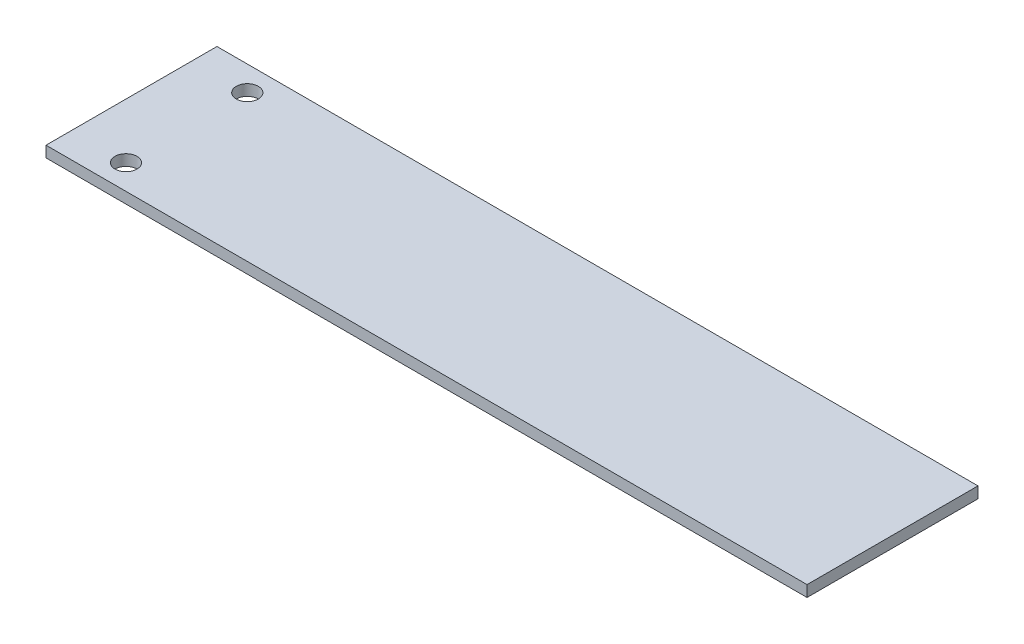
ISO-10303-21;
HEADER;
FILE_DESCRIPTION(('STEP AP214'),'2;1');
FILE_NAME('part.step','',(''),(''),'','','');
FILE_SCHEMA(('AUTOMOTIVE_DESIGN { 1 0 10303 214 1 1 1 1 }'));
ENDSEC;
DATA;
#1=APPLICATION_CONTEXT('core data for automotive mechanical design processes');
#2=APPLICATION_PROTOCOL_DEFINITION('international standard','automotive_design',2000,#1);
#3=PRODUCT_CONTEXT('',#1,'mechanical');
#4=PRODUCT('Part','Part','',(#3));
#5=PRODUCT_RELATED_PRODUCT_CATEGORY('part','',(#4));
#6=PRODUCT_DEFINITION_FORMATION('','',#4);
#7=PRODUCT_DEFINITION_CONTEXT('part definition',#1,'design');
#8=PRODUCT_DEFINITION('design','',#6,#7);
#9=PRODUCT_DEFINITION_SHAPE('','',#8);
#10=(LENGTH_UNIT() NAMED_UNIT(*) SI_UNIT(.MILLI.,.METRE.));
#11=(NAMED_UNIT(*) PLANE_ANGLE_UNIT() SI_UNIT($,.RADIAN.));
#12=(NAMED_UNIT(*) SI_UNIT($,.STERADIAN.) SOLID_ANGLE_UNIT());
#13=UNCERTAINTY_MEASURE_WITH_UNIT(LENGTH_MEASURE(1.E-05),#10,'distance_accuracy_value','');
#14=(GEOMETRIC_REPRESENTATION_CONTEXT(3) GLOBAL_UNCERTAINTY_ASSIGNED_CONTEXT((#13)) GLOBAL_UNIT_ASSIGNED_CONTEXT((#10,
#11,#12)) REPRESENTATION_CONTEXT('',''));
#15=CARTESIAN_POINT('',(0.,0.,0.));
#16=DIRECTION('',(0.,0.,1.));
#17=DIRECTION('',(1.,0.,0.));
#18=AXIS2_PLACEMENT_3D('',#15,#16,#17);
#19=CARTESIAN_POINT('',(0.,1.,0.));
#20=DIRECTION('',(0.,-1.,0.));
#21=DIRECTION('',(0.,0.,-1.));
#22=AXIS2_PLACEMENT_3D('',#19,#20,#21);
#23=PLANE('',#22);
#24=CARTESIAN_POINT('',(-6.80132450331126,1.,-5.25993377483443));
#25=DIRECTION('',(0.,1.,0.));
#26=DIRECTION('',(0.,0.,1.));
#27=AXIS2_PLACEMENT_3D('',#24,#25,#26);
#28=CIRCLE('',#27,0.999999999999997);
#29=CARTESIAN_POINT('',(-6.80132450331126,1.,-4.25993377483444));
#30=VERTEX_POINT('',#29);
#31=EDGE_CURVE('E156',#30,#30,#28,.T.);
#32=ORIENTED_EDGE('',*,*,#31,.F.);
#33=EDGE_LOOP('',(#32));
#34=FACE_BOUND('',#33,.T.);
#35=DIRECTION('',(0.,0.,1.));
#36=VECTOR('',#35,1.);
#37=CARTESIAN_POINT('',(-11.8013245033113,1.,7.99006622516557));
#38=LINE('',#37,#36);
#39=CARTESIAN_POINT('',(-11.8013245033113,1.,-7.50993377483443));
#40=VERTEX_POINT('',#39);
#41=CARTESIAN_POINT('',(-11.8013245033113,1.,7.99006622516557));
#42=VERTEX_POINT('',#41);
#43=EDGE_CURVE('E89',#40,#42,#38,.T.);
#44=ORIENTED_EDGE('',*,*,#43,.T.);
#45=DIRECTION('',(1.,0.,0.));
#46=VECTOR('',#45,1.);
#47=CARTESIAN_POINT('',(-11.8013245033113,1.,7.99006622516557));
#48=LINE('',#47,#46);
#49=CARTESIAN_POINT('',(57.1986754966888,1.,7.99006622516556));
#50=VERTEX_POINT('',#49);
#51=EDGE_CURVE('E173',#42,#50,#48,.T.);
#52=ORIENTED_EDGE('',*,*,#51,.T.);
#53=DIRECTION('',(0.,0.,1.));
#54=VECTOR('',#53,1.);
#55=CARTESIAN_POINT('',(57.1986754966888,1.,7.99006622516556));
#56=LINE('',#55,#54);
#57=CARTESIAN_POINT('',(57.1986754966887,1.,-7.50993377483445));
#58=VERTEX_POINT('',#57);
#59=EDGE_CURVE('E151',#58,#50,#56,.T.);
#60=ORIENTED_EDGE('',*,*,#59,.F.);
#61=DIRECTION('',(-1.,0.,0.));
#62=VECTOR('',#61,1.);
#63=CARTESIAN_POINT('',(-11.8013245033113,1.,-7.50993377483443));
#64=LINE('',#63,#62);
#65=EDGE_CURVE('E59',#58,#40,#64,.T.);
#66=ORIENTED_EDGE('',*,*,#65,.T.);
#67=EDGE_LOOP('',(#44,#52,#60,#66));
#68=FACE_BOUND('',#67,.T.);
#69=CARTESIAN_POINT('',(-6.80132450331126,1.,5.74006622516556));
#70=DIRECTION('',(0.,1.,0.));
#71=DIRECTION('',(0.,0.,1.));
#72=AXIS2_PLACEMENT_3D('',#69,#70,#71);
#73=CIRCLE('',#72,0.999999999999997);
#74=CARTESIAN_POINT('',(-6.80132450331126,1.,6.74006622516556));
#75=VERTEX_POINT('',#74);
#76=EDGE_CURVE('E105',#75,#75,#73,.T.);
#77=ORIENTED_EDGE('',*,*,#76,.F.);
#78=EDGE_LOOP('',(#77));
#79=FACE_BOUND('',#78,.T.);
#80=ADVANCED_FACE('F41',(#34,#68,#79),#23,.F.);
#81=CARTESIAN_POINT('',(-11.8013245033113,1.,7.99006622516557));
#82=DIRECTION('',(1.,0.,0.));
#83=DIRECTION('',(0.,0.,-1.));
#84=AXIS2_PLACEMENT_3D('',#81,#82,#83);
#85=PLANE('',#84);
#86=DIRECTION('',(0.,0.,1.));
#87=VECTOR('',#86,1.);
#88=CARTESIAN_POINT('',(-11.8013245033113,0.,7.99006622516557));
#89=LINE('',#88,#87);
#90=CARTESIAN_POINT('',(-11.8013245033113,0.,-7.50993377483443));
#91=VERTEX_POINT('',#90);
#92=CARTESIAN_POINT('',(-11.8013245033113,0.,7.99006622516557));
#93=VERTEX_POINT('',#92);
#94=EDGE_CURVE('E95',#91,#93,#89,.T.);
#95=ORIENTED_EDGE('',*,*,#94,.T.);
#96=DIRECTION('',(0.,-1.,0.));
#97=VECTOR('',#96,1.);
#98=CARTESIAN_POINT('',(-11.8013245033113,1.,7.99006622516557));
#99=LINE('',#98,#97);
#100=EDGE_CURVE('E11',#42,#93,#99,.T.);
#101=ORIENTED_EDGE('',*,*,#100,.F.);
#102=ORIENTED_EDGE('',*,*,#43,.F.);
#103=DIRECTION('',(0.,-1.,0.));
#104=VECTOR('',#103,1.);
#105=CARTESIAN_POINT('',(-11.8013245033113,1.,-7.50993377483443));
#106=LINE('',#105,#104);
#107=EDGE_CURVE('E51',#40,#91,#106,.T.);
#108=ORIENTED_EDGE('',*,*,#107,.T.);
#109=EDGE_LOOP('',(#95,#101,#102,#108));
#110=FACE_BOUND('',#109,.T.);
#111=ADVANCED_FACE('F43',(#110),#85,.F.);
#112=CARTESIAN_POINT('',(-11.8013245033113,1.,7.99006622516557));
#113=DIRECTION('',(0.,0.,-1.));
#114=DIRECTION('',(-1.,0.,0.));
#115=AXIS2_PLACEMENT_3D('',#112,#113,#114);
#116=PLANE('',#115);
#117=DIRECTION('',(1.,0.,0.));
#118=VECTOR('',#117,1.);
#119=CARTESIAN_POINT('',(-11.8013245033113,0.,7.99006622516557));
#120=LINE('',#119,#118);
#121=CARTESIAN_POINT('',(7.19867549668874,0.,7.99006622516557));
#122=VERTEX_POINT('',#121);
#123=EDGE_CURVE('E72',#93,#122,#120,.T.);
#124=ORIENTED_EDGE('',*,*,#123,.T.);
#125=DIRECTION('',(0.,-1.,0.));
#126=VECTOR('',#125,1.);
#127=CARTESIAN_POINT('',(7.19867549668874,1.,7.99006622516557));
#128=LINE('',#127,#126);
#129=CARTESIAN_POINT('',(7.19867549668874,-0.0159048308691668,7.99006622516557));
#130=VERTEX_POINT('',#129);
#131=EDGE_CURVE('E116',#122,#130,#128,.T.);
#132=ORIENTED_EDGE('',*,*,#131,.T.);
#133=DIRECTION('',(-1.,0.,0.));
#134=VECTOR('',#133,1.);
#135=CARTESIAN_POINT('',(57.1986754966888,-0.0159048308691668,7.99006622516556));
#136=LINE('',#135,#134);
#137=CARTESIAN_POINT('',(57.1986754966888,-0.0159048308691668,7.99006622516556));
#138=VERTEX_POINT('',#137);
#139=EDGE_CURVE('E139',#138,#130,#136,.T.);
#140=ORIENTED_EDGE('',*,*,#139,.F.);
#141=DIRECTION('',(0.,-1.,0.));
#142=VECTOR('',#141,1.);
#143=CARTESIAN_POINT('',(57.1986754966888,1.,7.99006622516556));
#144=LINE('',#143,#142);
#145=EDGE_CURVE('E146',#50,#138,#144,.T.);
#146=ORIENTED_EDGE('',*,*,#145,.F.);
#147=ORIENTED_EDGE('',*,*,#51,.F.);
#148=ORIENTED_EDGE('',*,*,#100,.T.);
#149=EDGE_LOOP('',(#124,#132,#140,#146,#147,#148));
#150=FACE_BOUND('',#149,.T.);
#151=ADVANCED_FACE('F154',(#150),#116,.F.);
#152=CARTESIAN_POINT('',(-11.8013245033113,1.,-7.50993377483443));
#153=DIRECTION('',(0.,0.,1.));
#154=DIRECTION('',(1.,0.,0.));
#155=AXIS2_PLACEMENT_3D('',#152,#153,#154);
#156=PLANE('',#155);
#157=DIRECTION('',(-1.,0.,0.));
#158=VECTOR('',#157,1.);
#159=CARTESIAN_POINT('',(-11.8013245033113,0.,-7.50993377483443));
#160=LINE('',#159,#158);
#161=CARTESIAN_POINT('',(7.19867549668874,0.,-7.50993377483443));
#162=VERTEX_POINT('',#161);
#163=EDGE_CURVE('E78',#162,#91,#160,.T.);
#164=ORIENTED_EDGE('',*,*,#163,.T.);
#165=ORIENTED_EDGE('',*,*,#107,.F.);
#166=ORIENTED_EDGE('',*,*,#65,.F.);
#167=DIRECTION('',(0.,1.,0.));
#168=VECTOR('',#167,1.);
#169=CARTESIAN_POINT('',(57.1986754966887,1.,-7.50993377483445));
#170=LINE('',#169,#168);
#171=CARTESIAN_POINT('',(57.1986754966887,-0.0159048308691668,-7.50993377483445));
#172=VERTEX_POINT('',#171);
#173=EDGE_CURVE('E145',#172,#58,#170,.T.);
#174=ORIENTED_EDGE('',*,*,#173,.F.);
#175=DIRECTION('',(-1.,0.,0.));
#176=VECTOR('',#175,1.);
#177=CARTESIAN_POINT('',(57.1986754966887,-0.0159048308691668,-7.50993377483445));
#178=LINE('',#177,#176);
#179=CARTESIAN_POINT('',(7.19867549668874,-0.0159048308691668,-7.50993377483443));
#180=VERTEX_POINT('',#179);
#181=EDGE_CURVE('E140',#172,#180,#178,.T.);
#182=ORIENTED_EDGE('',*,*,#181,.T.);
#183=DIRECTION('',(0.,1.,0.));
#184=VECTOR('',#183,1.);
#185=CARTESIAN_POINT('',(7.19867549668874,1.,-7.50993377483443));
#186=LINE('',#185,#184);
#187=EDGE_CURVE('E84',#180,#162,#186,.T.);
#188=ORIENTED_EDGE('',*,*,#187,.T.);
#189=EDGE_LOOP('',(#164,#165,#166,#174,#182,#188));
#190=FACE_BOUND('',#189,.T.);
#191=ADVANCED_FACE('F80',(#190),#156,.F.);
#192=CARTESIAN_POINT('',(0.,0.,0.));
#193=DIRECTION('',(0.,-1.,0.));
#194=DIRECTION('',(0.,0.,-1.));
#195=AXIS2_PLACEMENT_3D('',#192,#193,#194);
#196=PLANE('',#195);
#197=CARTESIAN_POINT('',(-6.80132450331126,0.,-5.25993377483443));
#198=DIRECTION('',(0.,-1.,0.));
#199=DIRECTION('',(0.,0.,-1.));
#200=AXIS2_PLACEMENT_3D('',#197,#198,#199);
#201=CIRCLE('',#200,0.999999999999995);
#202=CARTESIAN_POINT('',(-6.80132450331126,0.,-6.25993377483443));
#203=VERTEX_POINT('',#202);
#204=EDGE_CURVE('E161',#203,#203,#201,.T.);
#205=ORIENTED_EDGE('',*,*,#204,.F.);
#206=EDGE_LOOP('',(#205));
#207=FACE_BOUND('',#206,.T.);
#208=CARTESIAN_POINT('',(-6.80132450331126,0.,5.74006622516556));
#209=DIRECTION('',(0.,-1.,0.));
#210=DIRECTION('',(0.,0.,-1.));
#211=AXIS2_PLACEMENT_3D('',#208,#209,#210);
#212=CIRCLE('',#211,0.999999999999995);
#213=CARTESIAN_POINT('',(-6.80132450331126,0.,4.74006622516557));
#214=VERTEX_POINT('',#213);
#215=EDGE_CURVE('E99',#214,#214,#212,.T.);
#216=ORIENTED_EDGE('',*,*,#215,.F.);
#217=EDGE_LOOP('',(#216));
#218=FACE_BOUND('',#217,.T.);
#219=ORIENTED_EDGE('',*,*,#94,.F.);
#220=ORIENTED_EDGE('',*,*,#163,.F.);
#221=DIRECTION('',(0.,0.,-1.));
#222=VECTOR('',#221,1.);
#223=CARTESIAN_POINT('',(7.19867549668874,0.,7.99006622516557));
#224=LINE('',#223,#222);
#225=EDGE_CURVE('E90',#122,#162,#224,.T.);
#226=ORIENTED_EDGE('',*,*,#225,.F.);
#227=ORIENTED_EDGE('',*,*,#123,.F.);
#228=EDGE_LOOP('',(#219,#220,#226,#227));
#229=FACE_BOUND('',#228,.T.);
#230=ADVANCED_FACE('F97',(#207,#218,#229),#196,.T.);
#231=CARTESIAN_POINT('',(-6.80132450331126,1.,5.74006622516556));
#232=DIRECTION('',(0.,1.,0.));
#233=DIRECTION('',(0.,0.,1.));
#234=AXIS2_PLACEMENT_3D('',#231,#232,#233);
#235=CYLINDRICAL_SURFACE('',#234,0.999999999999995);
#236=ORIENTED_EDGE('',*,*,#215,.T.);
#237=EDGE_LOOP('',(#236));
#238=FACE_BOUND('',#237,.T.);
#239=ORIENTED_EDGE('',*,*,#76,.T.);
#240=EDGE_LOOP('',(#239));
#241=FACE_BOUND('',#240,.T.);
#242=ADVANCED_FACE('F192',(#238,#241),#235,.F.);
#243=CARTESIAN_POINT('',(-6.80132450331126,1.,-5.25993377483443));
#244=DIRECTION('',(0.,1.,0.));
#245=DIRECTION('',(0.,0.,1.));
#246=AXIS2_PLACEMENT_3D('',#243,#244,#245);
#247=CYLINDRICAL_SURFACE('',#246,0.999999999999995);
#248=ORIENTED_EDGE('',*,*,#204,.T.);
#249=EDGE_LOOP('',(#248));
#250=FACE_BOUND('',#249,.T.);
#251=ORIENTED_EDGE('',*,*,#31,.T.);
#252=EDGE_LOOP('',(#251));
#253=FACE_BOUND('',#252,.T.);
#254=ADVANCED_FACE('F194',(#250,#253),#247,.F.);
#255=CARTESIAN_POINT('',(7.19867549668874,0.,0.));
#256=DIRECTION('',(1.,0.,0.));
#257=DIRECTION('',(0.,0.,-1.));
#258=AXIS2_PLACEMENT_3D('',#255,#256,#257);
#259=PLANE('',#258);
#260=ORIENTED_EDGE('',*,*,#131,.F.);
#261=ORIENTED_EDGE('',*,*,#225,.T.);
#262=ORIENTED_EDGE('',*,*,#187,.F.);
#263=DIRECTION('',(0.,0.,-1.));
#264=VECTOR('',#263,1.);
#265=CARTESIAN_POINT('',(7.19867549668874,-0.0159048308691668,7.99006622516557));
#266=LINE('',#265,#264);
#267=EDGE_CURVE('E184',#130,#180,#266,.T.);
#268=ORIENTED_EDGE('',*,*,#267,.F.);
#269=EDGE_LOOP('',(#260,#261,#262,#268));
#270=FACE_BOUND('',#269,.T.);
#271=ADVANCED_FACE('F113',(#270),#259,.F.);
#272=CARTESIAN_POINT('',(57.1986754966888,-0.0159048308691668,7.99006622516556));
#273=DIRECTION('',(0.,1.,0.));
#274=DIRECTION('',(0.,0.,1.));
#275=AXIS2_PLACEMENT_3D('',#272,#273,#274);
#276=PLANE('',#275);
#277=ORIENTED_EDGE('',*,*,#267,.T.);
#278=ORIENTED_EDGE('',*,*,#181,.F.);
#279=DIRECTION('',(0.,0.,-1.));
#280=VECTOR('',#279,1.);
#281=CARTESIAN_POINT('',(57.1986754966888,-0.0159048308691668,7.99006622516556));
#282=LINE('',#281,#280);
#283=EDGE_CURVE('E135',#138,#172,#282,.T.);
#284=ORIENTED_EDGE('',*,*,#283,.F.);
#285=ORIENTED_EDGE('',*,*,#139,.T.);
#286=EDGE_LOOP('',(#277,#278,#284,#285));
#287=FACE_BOUND('',#286,.T.);
#288=ADVANCED_FACE('F137',(#287),#276,.F.);
#289=CARTESIAN_POINT('',(57.1986754966887,0.,0.));
#290=DIRECTION('',(1.,0.,0.));
#291=DIRECTION('',(0.,0.,-1.));
#292=AXIS2_PLACEMENT_3D('',#289,#290,#291);
#293=PLANE('',#292);
#294=ORIENTED_EDGE('',*,*,#145,.T.);
#295=ORIENTED_EDGE('',*,*,#283,.T.);
#296=ORIENTED_EDGE('',*,*,#173,.T.);
#297=ORIENTED_EDGE('',*,*,#59,.T.);
#298=EDGE_LOOP('',(#294,#295,#296,#297));
#299=FACE_BOUND('',#298,.T.);
#300=ADVANCED_FACE('F150',(#299),#293,.T.);
#301=CLOSED_SHELL('',(#80,#111,#151,#191,#230,#242,#254,#271,#288,#300));
#302=MANIFOLD_SOLID_BREP('B2',#301);
#303=ADVANCED_BREP_SHAPE_REPRESENTATION('',(#18,#302),#14);
#304=SHAPE_DEFINITION_REPRESENTATION(#9,#303);
ENDSEC;
END-ISO-10303-21;
